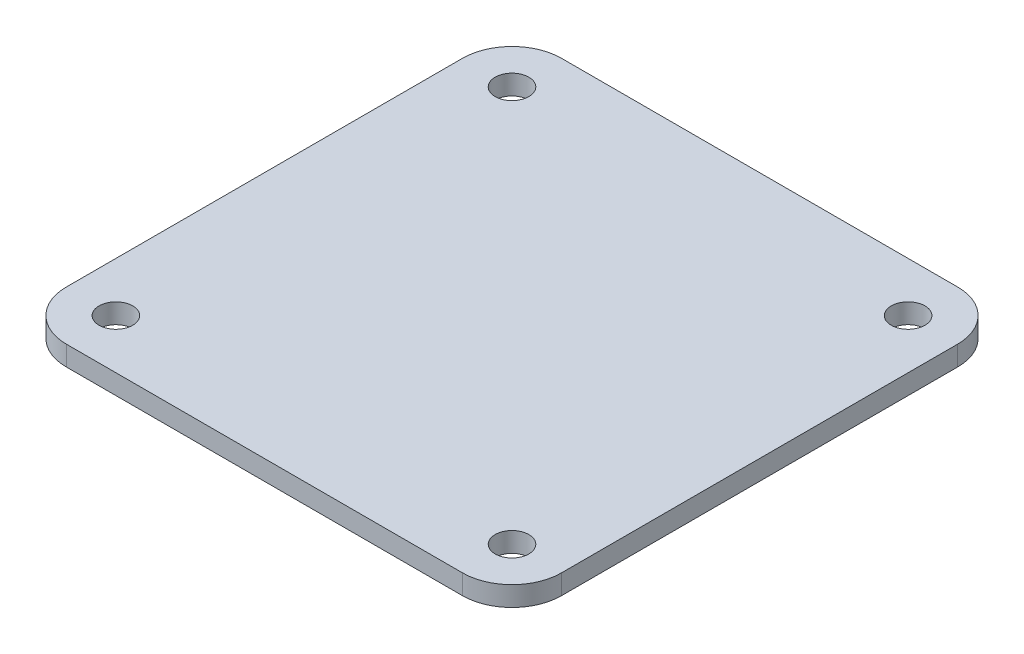
ISO-10303-21;
HEADER;
FILE_DESCRIPTION(('STEP AP214'),'2;1');
FILE_NAME('part.step','',(''),(''),'','','');
FILE_SCHEMA(('AUTOMOTIVE_DESIGN { 1 0 10303 214 1 1 1 1 }'));
ENDSEC;
DATA;
#1=APPLICATION_CONTEXT('core data for automotive mechanical design processes');
#2=APPLICATION_PROTOCOL_DEFINITION('international standard','automotive_design',2000,#1);
#3=PRODUCT_CONTEXT('',#1,'mechanical');
#4=PRODUCT('Part','Part','',(#3));
#5=PRODUCT_RELATED_PRODUCT_CATEGORY('part','',(#4));
#6=PRODUCT_DEFINITION_FORMATION('','',#4);
#7=PRODUCT_DEFINITION_CONTEXT('part definition',#1,'design');
#8=PRODUCT_DEFINITION('design','',#6,#7);
#9=PRODUCT_DEFINITION_SHAPE('','',#8);
#10=(LENGTH_UNIT() NAMED_UNIT(*) SI_UNIT(.MILLI.,.METRE.));
#11=(NAMED_UNIT(*) PLANE_ANGLE_UNIT() SI_UNIT($,.RADIAN.));
#12=(NAMED_UNIT(*) SI_UNIT($,.STERADIAN.) SOLID_ANGLE_UNIT());
#13=UNCERTAINTY_MEASURE_WITH_UNIT(LENGTH_MEASURE(1.E-05),#10,'distance_accuracy_value','');
#14=(GEOMETRIC_REPRESENTATION_CONTEXT(3) GLOBAL_UNCERTAINTY_ASSIGNED_CONTEXT((#13)) GLOBAL_UNIT_ASSIGNED_CONTEXT((#10,
#11,#12)) REPRESENTATION_CONTEXT('',''));
#15=CARTESIAN_POINT('',(0.,0.,0.));
#16=DIRECTION('',(0.,0.,1.));
#17=DIRECTION('',(1.,0.,0.));
#18=AXIS2_PLACEMENT_3D('',#15,#16,#17);
#19=CARTESIAN_POINT('',(-20.,-4.,-20.));
#20=DIRECTION('',(0.,-1.,0.));
#21=DIRECTION('',(0.,0.,-1.));
#22=AXIS2_PLACEMENT_3D('',#19,#20,#21);
#23=PLANE('',#22);
#24=CARTESIAN_POINT('',(-20.,-4.,-20.));
#25=DIRECTION('',(0.,-1.,0.));
#26=DIRECTION('',(0.,0.,-1.));
#27=AXIS2_PLACEMENT_3D('',#24,#25,#26);
#28=CIRCLE('',#27,1.7);
#29=CARTESIAN_POINT('',(-20.,-4.,-21.7));
#30=VERTEX_POINT('',#29);
#31=EDGE_CURVE('E188',#30,#30,#28,.T.);
#32=ORIENTED_EDGE('',*,*,#31,.F.);
#33=EDGE_LOOP('',(#32));
#34=FACE_BOUND('',#33,.T.);
#35=CARTESIAN_POINT('',(-20.,-4.,20.));
#36=DIRECTION('',(0.,-1.,0.));
#37=DIRECTION('',(0.,0.,-1.));
#38=AXIS2_PLACEMENT_3D('',#35,#36,#37);
#39=CIRCLE('',#38,1.7);
#40=CARTESIAN_POINT('',(-20.,-4.,18.3));
#41=VERTEX_POINT('',#40);
#42=EDGE_CURVE('E134',#41,#41,#39,.T.);
#43=ORIENTED_EDGE('',*,*,#42,.F.);
#44=EDGE_LOOP('',(#43));
#45=FACE_BOUND('',#44,.T.);
#46=CARTESIAN_POINT('',(-20.,-4.,-20.));
#47=DIRECTION('',(0.,-1.,0.));
#48=DIRECTION('',(0.,0.,-1.));
#49=AXIS2_PLACEMENT_3D('',#46,#47,#48);
#50=CIRCLE('',#49,5.);
#51=CARTESIAN_POINT('',(-25.,-4.,-20.));
#52=VERTEX_POINT('',#51);
#53=CARTESIAN_POINT('',(-20.,-4.,-25.));
#54=VERTEX_POINT('',#53);
#55=EDGE_CURVE('E145',#52,#54,#50,.T.);
#56=ORIENTED_EDGE('',*,*,#55,.T.);
#57=DIRECTION('',(1.,0.,0.));
#58=VECTOR('',#57,1.);
#59=CARTESIAN_POINT('',(-20.,-4.,-25.));
#60=LINE('',#59,#58);
#61=CARTESIAN_POINT('',(20.,-4.,-25.));
#62=VERTEX_POINT('',#61);
#63=EDGE_CURVE('E93',#54,#62,#60,.T.);
#64=ORIENTED_EDGE('',*,*,#63,.T.);
#65=CARTESIAN_POINT('',(20.,-4.,-20.));
#66=DIRECTION('',(0.,-1.,0.));
#67=DIRECTION('',(0.,0.,-1.));
#68=AXIS2_PLACEMENT_3D('',#65,#66,#67);
#69=CIRCLE('',#68,5.);
#70=CARTESIAN_POINT('',(25.,-4.,-20.));
#71=VERTEX_POINT('',#70);
#72=EDGE_CURVE('E160',#62,#71,#69,.T.);
#73=ORIENTED_EDGE('',*,*,#72,.T.);
#74=DIRECTION('',(0.,0.,1.));
#75=VECTOR('',#74,1.);
#76=CARTESIAN_POINT('',(25.,-4.,20.));
#77=LINE('',#76,#75);
#78=CARTESIAN_POINT('',(25.,-4.,20.));
#79=VERTEX_POINT('',#78);
#80=EDGE_CURVE('E173',#71,#79,#77,.T.);
#81=ORIENTED_EDGE('',*,*,#80,.T.);
#82=CARTESIAN_POINT('',(20.,-4.,20.));
#83=DIRECTION('',(0.,-1.,0.));
#84=DIRECTION('',(0.,0.,-1.));
#85=AXIS2_PLACEMENT_3D('',#82,#83,#84);
#86=CIRCLE('',#85,5.);
#87=CARTESIAN_POINT('',(20.,-4.,25.));
#88=VERTEX_POINT('',#87);
#89=EDGE_CURVE('E112',#79,#88,#86,.T.);
#90=ORIENTED_EDGE('',*,*,#89,.T.);
#91=DIRECTION('',(-1.,0.,0.));
#92=VECTOR('',#91,1.);
#93=CARTESIAN_POINT('',(-20.,-4.,25.));
#94=LINE('',#93,#92);
#95=CARTESIAN_POINT('',(-20.,-4.,25.));
#96=VERTEX_POINT('',#95);
#97=EDGE_CURVE('E106',#88,#96,#94,.T.);
#98=ORIENTED_EDGE('',*,*,#97,.T.);
#99=CARTESIAN_POINT('',(-20.,-4.,20.));
#100=DIRECTION('',(0.,-1.,0.));
#101=DIRECTION('',(0.,0.,-1.));
#102=AXIS2_PLACEMENT_3D('',#99,#100,#101);
#103=CIRCLE('',#102,5.);
#104=CARTESIAN_POINT('',(-25.,-4.,20.));
#105=VERTEX_POINT('',#104);
#106=EDGE_CURVE('E110',#96,#105,#103,.T.);
#107=ORIENTED_EDGE('',*,*,#106,.T.);
#108=DIRECTION('',(0.,0.,-1.));
#109=VECTOR('',#108,1.);
#110=CARTESIAN_POINT('',(-25.,-4.,20.));
#111=LINE('',#110,#109);
#112=EDGE_CURVE('E50',#105,#52,#111,.T.);
#113=ORIENTED_EDGE('',*,*,#112,.T.);
#114=EDGE_LOOP('',(#56,#64,#73,#81,#90,#98,#107,#113));
#115=FACE_BOUND('',#114,.T.);
#116=CARTESIAN_POINT('',(20.,-4.,20.));
#117=DIRECTION('',(0.,-1.,0.));
#118=DIRECTION('',(0.,0.,-1.));
#119=AXIS2_PLACEMENT_3D('',#116,#117,#118);
#120=CIRCLE('',#119,1.7);
#121=CARTESIAN_POINT('',(20.,-4.,18.3));
#122=VERTEX_POINT('',#121);
#123=EDGE_CURVE('E182',#122,#122,#120,.T.);
#124=ORIENTED_EDGE('',*,*,#123,.F.);
#125=EDGE_LOOP('',(#124));
#126=FACE_BOUND('',#125,.T.);
#127=CARTESIAN_POINT('',(20.,-4.,-20.));
#128=DIRECTION('',(0.,-1.,0.));
#129=DIRECTION('',(0.,0.,-1.));
#130=AXIS2_PLACEMENT_3D('',#127,#128,#129);
#131=CIRCLE('',#130,1.7);
#132=CARTESIAN_POINT('',(20.,-4.,-21.7));
#133=VERTEX_POINT('',#132);
#134=EDGE_CURVE('E194',#133,#133,#131,.T.);
#135=ORIENTED_EDGE('',*,*,#134,.F.);
#136=EDGE_LOOP('',(#135));
#137=FACE_BOUND('',#136,.T.);
#138=ADVANCED_FACE('F33',(#34,#45,#115,#126,#137),#23,.T.);
#139=CARTESIAN_POINT('',(-20.,-2.,-20.));
#140=DIRECTION('',(0.,-1.,0.));
#141=DIRECTION('',(0.,0.,-1.));
#142=AXIS2_PLACEMENT_3D('',#139,#140,#141);
#143=PLANE('',#142);
#144=CARTESIAN_POINT('',(-20.,-2.,-20.));
#145=DIRECTION('',(0.,-1.,0.));
#146=DIRECTION('',(0.,0.,-1.));
#147=AXIS2_PLACEMENT_3D('',#144,#145,#146);
#148=CIRCLE('',#147,5.);
#149=CARTESIAN_POINT('',(-25.,-2.,-20.));
#150=VERTEX_POINT('',#149);
#151=CARTESIAN_POINT('',(-20.,-2.,-25.));
#152=VERTEX_POINT('',#151);
#153=EDGE_CURVE('E130',#150,#152,#148,.T.);
#154=ORIENTED_EDGE('',*,*,#153,.F.);
#155=DIRECTION('',(0.,0.,-1.));
#156=VECTOR('',#155,1.);
#157=CARTESIAN_POINT('',(-25.,-2.,20.));
#158=LINE('',#157,#156);
#159=CARTESIAN_POINT('',(-25.,-2.,20.));
#160=VERTEX_POINT('',#159);
#161=EDGE_CURVE('E85',#160,#150,#158,.T.);
#162=ORIENTED_EDGE('',*,*,#161,.F.);
#163=CARTESIAN_POINT('',(-20.,-2.,20.));
#164=DIRECTION('',(0.,-1.,0.));
#165=DIRECTION('',(0.,0.,-1.));
#166=AXIS2_PLACEMENT_3D('',#163,#164,#165);
#167=CIRCLE('',#166,5.);
#168=CARTESIAN_POINT('',(-20.,-2.,25.));
#169=VERTEX_POINT('',#168);
#170=EDGE_CURVE('E79',#169,#160,#167,.T.);
#171=ORIENTED_EDGE('',*,*,#170,.F.);
#172=DIRECTION('',(-1.,0.,0.));
#173=VECTOR('',#172,1.);
#174=CARTESIAN_POINT('',(-20.,-2.,25.));
#175=LINE('',#174,#173);
#176=CARTESIAN_POINT('',(20.,-2.,25.));
#177=VERTEX_POINT('',#176);
#178=EDGE_CURVE('E120',#177,#169,#175,.T.);
#179=ORIENTED_EDGE('',*,*,#178,.F.);
#180=CARTESIAN_POINT('',(20.,-2.,20.));
#181=DIRECTION('',(0.,-1.,0.));
#182=DIRECTION('',(0.,0.,-1.));
#183=AXIS2_PLACEMENT_3D('',#180,#181,#182);
#184=CIRCLE('',#183,5.);
#185=CARTESIAN_POINT('',(25.,-2.,20.));
#186=VERTEX_POINT('',#185);
#187=EDGE_CURVE('E140',#186,#177,#184,.T.);
#188=ORIENTED_EDGE('',*,*,#187,.F.);
#189=DIRECTION('',(0.,0.,1.));
#190=VECTOR('',#189,1.);
#191=CARTESIAN_POINT('',(25.,-2.,20.));
#192=LINE('',#191,#190);
#193=CARTESIAN_POINT('',(25.,-2.,-20.));
#194=VERTEX_POINT('',#193);
#195=EDGE_CURVE('E138',#194,#186,#192,.T.);
#196=ORIENTED_EDGE('',*,*,#195,.F.);
#197=CARTESIAN_POINT('',(20.,-2.,-20.));
#198=DIRECTION('',(0.,-1.,0.));
#199=DIRECTION('',(0.,0.,-1.));
#200=AXIS2_PLACEMENT_3D('',#197,#198,#199);
#201=CIRCLE('',#200,5.);
#202=CARTESIAN_POINT('',(20.,-2.,-25.));
#203=VERTEX_POINT('',#202);
#204=EDGE_CURVE('E136',#203,#194,#201,.T.);
#205=ORIENTED_EDGE('',*,*,#204,.F.);
#206=DIRECTION('',(1.,0.,0.));
#207=VECTOR('',#206,1.);
#208=CARTESIAN_POINT('',(-20.,-2.,-25.));
#209=LINE('',#208,#207);
#210=EDGE_CURVE('E133',#152,#203,#209,.T.);
#211=ORIENTED_EDGE('',*,*,#210,.F.);
#212=EDGE_LOOP('',(#154,#162,#171,#179,#188,#196,#205,#211));
#213=FACE_BOUND('',#212,.T.);
#214=CARTESIAN_POINT('',(-20.,-2.,20.));
#215=DIRECTION('',(0.,-1.,0.));
#216=DIRECTION('',(0.,0.,-1.));
#217=AXIS2_PLACEMENT_3D('',#214,#215,#216);
#218=CIRCLE('',#217,1.7);
#219=CARTESIAN_POINT('',(-20.,-2.,18.3));
#220=VERTEX_POINT('',#219);
#221=EDGE_CURVE('E179',#220,#220,#218,.T.);
#222=ORIENTED_EDGE('',*,*,#221,.T.);
#223=EDGE_LOOP('',(#222));
#224=FACE_BOUND('',#223,.T.);
#225=CARTESIAN_POINT('',(20.,-2.,20.));
#226=DIRECTION('',(0.,-1.,0.));
#227=DIRECTION('',(0.,0.,-1.));
#228=AXIS2_PLACEMENT_3D('',#225,#226,#227);
#229=CIRCLE('',#228,1.7);
#230=CARTESIAN_POINT('',(20.,-2.,18.3));
#231=VERTEX_POINT('',#230);
#232=EDGE_CURVE('E185',#231,#231,#229,.T.);
#233=ORIENTED_EDGE('',*,*,#232,.T.);
#234=EDGE_LOOP('',(#233));
#235=FACE_BOUND('',#234,.T.);
#236=CARTESIAN_POINT('',(-20.,-2.,-20.));
#237=DIRECTION('',(0.,-1.,0.));
#238=DIRECTION('',(0.,0.,-1.));
#239=AXIS2_PLACEMENT_3D('',#236,#237,#238);
#240=CIRCLE('',#239,1.7);
#241=CARTESIAN_POINT('',(-20.,-2.,-21.7));
#242=VERTEX_POINT('',#241);
#243=EDGE_CURVE('E191',#242,#242,#240,.T.);
#244=ORIENTED_EDGE('',*,*,#243,.T.);
#245=EDGE_LOOP('',(#244));
#246=FACE_BOUND('',#245,.T.);
#247=CARTESIAN_POINT('',(20.,-2.,-20.));
#248=DIRECTION('',(0.,-1.,0.));
#249=DIRECTION('',(0.,0.,-1.));
#250=AXIS2_PLACEMENT_3D('',#247,#248,#249);
#251=CIRCLE('',#250,1.7);
#252=CARTESIAN_POINT('',(20.,-2.,-21.7));
#253=VERTEX_POINT('',#252);
#254=EDGE_CURVE('E197',#253,#253,#251,.T.);
#255=ORIENTED_EDGE('',*,*,#254,.T.);
#256=EDGE_LOOP('',(#255));
#257=FACE_BOUND('',#256,.T.);
#258=ADVANCED_FACE('F164',(#213,#224,#235,#246,#257),#143,.F.);
#259=CARTESIAN_POINT('',(-20.,-4.,-20.));
#260=DIRECTION('',(0.,1.,0.));
#261=DIRECTION('',(0.,0.,1.));
#262=AXIS2_PLACEMENT_3D('',#259,#260,#261);
#263=CYLINDRICAL_SURFACE('',#262,5.);
#264=ORIENTED_EDGE('',*,*,#153,.T.);
#265=DIRECTION('',(0.,1.,0.));
#266=VECTOR('',#265,1.);
#267=CARTESIAN_POINT('',(-20.,-4.,-25.));
#268=LINE('',#267,#266);
#269=EDGE_CURVE('E11',#54,#152,#268,.T.);
#270=ORIENTED_EDGE('',*,*,#269,.F.);
#271=ORIENTED_EDGE('',*,*,#55,.F.);
#272=DIRECTION('',(0.,1.,0.));
#273=VECTOR('',#272,1.);
#274=CARTESIAN_POINT('',(-25.,-4.,-20.));
#275=LINE('',#274,#273);
#276=EDGE_CURVE('E126',#52,#150,#275,.T.);
#277=ORIENTED_EDGE('',*,*,#276,.T.);
#278=EDGE_LOOP('',(#264,#270,#271,#277));
#279=FACE_BOUND('',#278,.T.);
#280=ADVANCED_FACE('F35',(#279),#263,.T.);
#281=CARTESIAN_POINT('',(-20.,-4.,-25.));
#282=DIRECTION('',(0.,0.,1.));
#283=DIRECTION('',(1.,0.,0.));
#284=AXIS2_PLACEMENT_3D('',#281,#282,#283);
#285=PLANE('',#284);
#286=ORIENTED_EDGE('',*,*,#210,.T.);
#287=DIRECTION('',(0.,1.,0.));
#288=VECTOR('',#287,1.);
#289=CARTESIAN_POINT('',(20.,-4.,-25.));
#290=LINE('',#289,#288);
#291=EDGE_CURVE('E42',#62,#203,#290,.T.);
#292=ORIENTED_EDGE('',*,*,#291,.F.);
#293=ORIENTED_EDGE('',*,*,#63,.F.);
#294=ORIENTED_EDGE('',*,*,#269,.T.);
#295=EDGE_LOOP('',(#286,#292,#293,#294));
#296=FACE_BOUND('',#295,.T.);
#297=ADVANCED_FACE('F231',(#296),#285,.F.);
#298=CARTESIAN_POINT('',(20.,-4.,-20.));
#299=DIRECTION('',(0.,1.,0.));
#300=DIRECTION('',(0.,0.,1.));
#301=AXIS2_PLACEMENT_3D('',#298,#299,#300);
#302=CYLINDRICAL_SURFACE('',#301,5.);
#303=ORIENTED_EDGE('',*,*,#204,.T.);
#304=DIRECTION('',(0.,1.,0.));
#305=VECTOR('',#304,1.);
#306=CARTESIAN_POINT('',(25.,-4.,-20.));
#307=LINE('',#306,#305);
#308=EDGE_CURVE('E152',#71,#194,#307,.T.);
#309=ORIENTED_EDGE('',*,*,#308,.F.);
#310=ORIENTED_EDGE('',*,*,#72,.F.);
#311=ORIENTED_EDGE('',*,*,#291,.T.);
#312=EDGE_LOOP('',(#303,#309,#310,#311));
#313=FACE_BOUND('',#312,.T.);
#314=ADVANCED_FACE('F158',(#313),#302,.T.);
#315=CARTESIAN_POINT('',(25.,-4.,20.));
#316=DIRECTION('',(-1.,0.,0.));
#317=DIRECTION('',(0.,0.,1.));
#318=AXIS2_PLACEMENT_3D('',#315,#316,#317);
#319=PLANE('',#318);
#320=ORIENTED_EDGE('',*,*,#195,.T.);
#321=DIRECTION('',(0.,1.,0.));
#322=VECTOR('',#321,1.);
#323=CARTESIAN_POINT('',(25.,-4.,20.));
#324=LINE('',#323,#322);
#325=EDGE_CURVE('E149',#79,#186,#324,.T.);
#326=ORIENTED_EDGE('',*,*,#325,.F.);
#327=ORIENTED_EDGE('',*,*,#80,.F.);
#328=ORIENTED_EDGE('',*,*,#308,.T.);
#329=EDGE_LOOP('',(#320,#326,#327,#328));
#330=FACE_BOUND('',#329,.T.);
#331=ADVANCED_FACE('F169',(#330),#319,.F.);
#332=CARTESIAN_POINT('',(20.,-4.,20.));
#333=DIRECTION('',(0.,1.,0.));
#334=DIRECTION('',(0.,0.,1.));
#335=AXIS2_PLACEMENT_3D('',#332,#333,#334);
#336=CYLINDRICAL_SURFACE('',#335,5.);
#337=ORIENTED_EDGE('',*,*,#187,.T.);
#338=DIRECTION('',(0.,1.,0.));
#339=VECTOR('',#338,1.);
#340=CARTESIAN_POINT('',(20.,-4.,25.));
#341=LINE('',#340,#339);
#342=EDGE_CURVE('E121',#88,#177,#341,.T.);
#343=ORIENTED_EDGE('',*,*,#342,.F.);
#344=ORIENTED_EDGE('',*,*,#89,.F.);
#345=ORIENTED_EDGE('',*,*,#325,.T.);
#346=EDGE_LOOP('',(#337,#343,#344,#345));
#347=FACE_BOUND('',#346,.T.);
#348=ADVANCED_FACE('F172',(#347),#336,.T.);
#349=CARTESIAN_POINT('',(-20.,-4.,25.));
#350=DIRECTION('',(0.,0.,-1.));
#351=DIRECTION('',(-1.,0.,0.));
#352=AXIS2_PLACEMENT_3D('',#349,#350,#351);
#353=PLANE('',#352);
#354=ORIENTED_EDGE('',*,*,#178,.T.);
#355=DIRECTION('',(0.,1.,0.));
#356=VECTOR('',#355,1.);
#357=CARTESIAN_POINT('',(-20.,-4.,25.));
#358=LINE('',#357,#356);
#359=EDGE_CURVE('E117',#96,#169,#358,.T.);
#360=ORIENTED_EDGE('',*,*,#359,.F.);
#361=ORIENTED_EDGE('',*,*,#97,.F.);
#362=ORIENTED_EDGE('',*,*,#342,.T.);
#363=EDGE_LOOP('',(#354,#360,#361,#362));
#364=FACE_BOUND('',#363,.T.);
#365=ADVANCED_FACE('F118',(#364),#353,.F.);
#366=CARTESIAN_POINT('',(-20.,-4.,20.));
#367=DIRECTION('',(0.,1.,0.));
#368=DIRECTION('',(0.,0.,1.));
#369=AXIS2_PLACEMENT_3D('',#366,#367,#368);
#370=CYLINDRICAL_SURFACE('',#369,5.);
#371=ORIENTED_EDGE('',*,*,#170,.T.);
#372=DIRECTION('',(0.,1.,0.));
#373=VECTOR('',#372,1.);
#374=CARTESIAN_POINT('',(-25.,-4.,20.));
#375=LINE('',#374,#373);
#376=EDGE_CURVE('E122',#105,#160,#375,.T.);
#377=ORIENTED_EDGE('',*,*,#376,.F.);
#378=ORIENTED_EDGE('',*,*,#106,.F.);
#379=ORIENTED_EDGE('',*,*,#359,.T.);
#380=EDGE_LOOP('',(#371,#377,#378,#379));
#381=FACE_BOUND('',#380,.T.);
#382=ADVANCED_FACE('F124',(#381),#370,.T.);
#383=CARTESIAN_POINT('',(-25.,-4.,20.));
#384=DIRECTION('',(1.,0.,0.));
#385=DIRECTION('',(0.,0.,-1.));
#386=AXIS2_PLACEMENT_3D('',#383,#384,#385);
#387=PLANE('',#386);
#388=ORIENTED_EDGE('',*,*,#161,.T.);
#389=ORIENTED_EDGE('',*,*,#276,.F.);
#390=ORIENTED_EDGE('',*,*,#112,.F.);
#391=ORIENTED_EDGE('',*,*,#376,.T.);
#392=EDGE_LOOP('',(#388,#389,#390,#391));
#393=FACE_BOUND('',#392,.T.);
#394=ADVANCED_FACE('F219',(#393),#387,.F.);
#395=CARTESIAN_POINT('',(-20.,-4.,20.));
#396=DIRECTION('',(0.,1.,0.));
#397=DIRECTION('',(0.,0.,1.));
#398=AXIS2_PLACEMENT_3D('',#395,#396,#397);
#399=CYLINDRICAL_SURFACE('',#398,1.7);
#400=ORIENTED_EDGE('',*,*,#42,.T.);
#401=EDGE_LOOP('',(#400));
#402=FACE_BOUND('',#401,.T.);
#403=ORIENTED_EDGE('',*,*,#221,.F.);
#404=EDGE_LOOP('',(#403));
#405=FACE_BOUND('',#404,.T.);
#406=ADVANCED_FACE('F216',(#402,#405),#399,.F.);
#407=CARTESIAN_POINT('',(20.,-4.,20.));
#408=DIRECTION('',(0.,1.,0.));
#409=DIRECTION('',(0.,0.,1.));
#410=AXIS2_PLACEMENT_3D('',#407,#408,#409);
#411=CYLINDRICAL_SURFACE('',#410,1.7);
#412=ORIENTED_EDGE('',*,*,#123,.T.);
#413=EDGE_LOOP('',(#412));
#414=FACE_BOUND('',#413,.T.);
#415=ORIENTED_EDGE('',*,*,#232,.F.);
#416=EDGE_LOOP('',(#415));
#417=FACE_BOUND('',#416,.T.);
#418=ADVANCED_FACE('F295',(#414,#417),#411,.F.);
#419=CARTESIAN_POINT('',(-20.,-4.,-20.));
#420=DIRECTION('',(0.,1.,0.));
#421=DIRECTION('',(0.,0.,1.));
#422=AXIS2_PLACEMENT_3D('',#419,#420,#421);
#423=CYLINDRICAL_SURFACE('',#422,1.7);
#424=ORIENTED_EDGE('',*,*,#31,.T.);
#425=EDGE_LOOP('',(#424));
#426=FACE_BOUND('',#425,.T.);
#427=ORIENTED_EDGE('',*,*,#243,.F.);
#428=EDGE_LOOP('',(#427));
#429=FACE_BOUND('',#428,.T.);
#430=ADVANCED_FACE('F303',(#426,#429),#423,.F.);
#431=CARTESIAN_POINT('',(20.,-4.,-20.));
#432=DIRECTION('',(0.,1.,0.));
#433=DIRECTION('',(0.,0.,1.));
#434=AXIS2_PLACEMENT_3D('',#431,#432,#433);
#435=CYLINDRICAL_SURFACE('',#434,1.7);
#436=ORIENTED_EDGE('',*,*,#134,.T.);
#437=EDGE_LOOP('',(#436));
#438=FACE_BOUND('',#437,.T.);
#439=ORIENTED_EDGE('',*,*,#254,.F.);
#440=EDGE_LOOP('',(#439));
#441=FACE_BOUND('',#440,.T.);
#442=ADVANCED_FACE('F203',(#438,#441),#435,.F.);
#443=CLOSED_SHELL('',(#138,#258,#280,#297,#314,#331,#348,#365,#382,#394,#406,#418,#430,#442));
#444=MANIFOLD_SOLID_BREP('B2',#443);
#445=ADVANCED_BREP_SHAPE_REPRESENTATION('',(#18,#444),#14);
#446=SHAPE_DEFINITION_REPRESENTATION(#9,#445);
ENDSEC;
END-ISO-10303-21;
